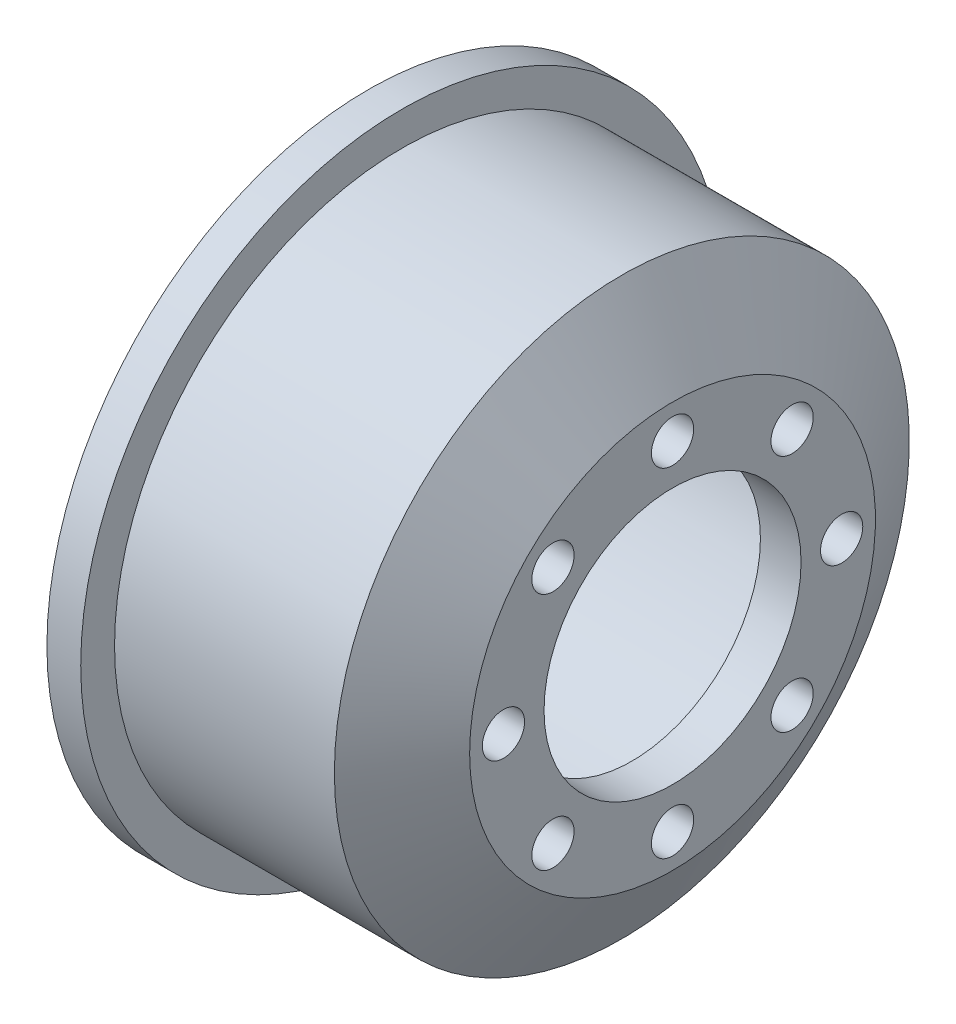
ISO-10303-21;
HEADER;
FILE_DESCRIPTION(('STEP AP214'),'2;1');
FILE_NAME('part.step','',(''),(''),'','','');
FILE_SCHEMA(('AUTOMOTIVE_DESIGN { 1 0 10303 214 1 1 1 1 }'));
ENDSEC;
DATA;
#1=APPLICATION_CONTEXT('core data for automotive mechanical design processes');
#2=APPLICATION_PROTOCOL_DEFINITION('international standard','automotive_design',2000,#1);
#3=PRODUCT_CONTEXT('',#1,'mechanical');
#4=PRODUCT('Part','Part','',(#3));
#5=PRODUCT_RELATED_PRODUCT_CATEGORY('part','',(#4));
#6=PRODUCT_DEFINITION_FORMATION('','',#4);
#7=PRODUCT_DEFINITION_CONTEXT('part definition',#1,'design');
#8=PRODUCT_DEFINITION('design','',#6,#7);
#9=PRODUCT_DEFINITION_SHAPE('','',#8);
#10=(LENGTH_UNIT() NAMED_UNIT(*) SI_UNIT(.MILLI.,.METRE.));
#11=(NAMED_UNIT(*) PLANE_ANGLE_UNIT() SI_UNIT($,.RADIAN.));
#12=(NAMED_UNIT(*) SI_UNIT($,.STERADIAN.) SOLID_ANGLE_UNIT());
#13=UNCERTAINTY_MEASURE_WITH_UNIT(LENGTH_MEASURE(1.E-05),#10,'distance_accuracy_value','');
#14=(GEOMETRIC_REPRESENTATION_CONTEXT(3) GLOBAL_UNCERTAINTY_ASSIGNED_CONTEXT((#13)) GLOBAL_UNIT_ASSIGNED_CONTEXT((#10,
#11,#12)) REPRESENTATION_CONTEXT('',''));
#15=CARTESIAN_POINT('',(0.,0.,0.));
#16=DIRECTION('',(0.,0.,1.));
#17=DIRECTION('',(1.,0.,0.));
#18=AXIS2_PLACEMENT_3D('',#15,#16,#17);
#19=CARTESIAN_POINT('',(-37.2788661687838,0.,0.));
#20=DIRECTION('',(-1.,0.,0.));
#21=DIRECTION('',(0.,0.,1.));
#22=AXIS2_PLACEMENT_3D('',#19,#20,#21);
#23=CYLINDRICAL_SURFACE('',#22,7.6);
#24=CARTESIAN_POINT('',(10.1398131593203,0.,0.));
#25=DIRECTION('',(-1.,0.,0.));
#26=DIRECTION('',(0.,0.,1.));
#27=AXIS2_PLACEMENT_3D('',#24,#25,#26);
#28=CIRCLE('',#27,7.6);
#29=CARTESIAN_POINT('',(10.1398131593203,0.,7.6));
#30=VERTEX_POINT('',#29);
#31=EDGE_CURVE('E10',#30,#30,#28,.T.);
#32=ORIENTED_EDGE('',*,*,#31,.F.);
#33=EDGE_LOOP('',(#32));
#34=FACE_BOUND('',#33,.T.);
#35=CARTESIAN_POINT('',(7.73636722696176,0.,0.));
#36=DIRECTION('',(-1.,0.,0.));
#37=DIRECTION('',(0.,0.,1.));
#38=AXIS2_PLACEMENT_3D('',#35,#36,#37);
#39=CIRCLE('',#38,7.6);
#40=CARTESIAN_POINT('',(7.73636722696176,0.,7.6));
#41=VERTEX_POINT('',#40);
#42=EDGE_CURVE('E71',#41,#41,#39,.T.);
#43=ORIENTED_EDGE('',*,*,#42,.T.);
#44=EDGE_LOOP('',(#43));
#45=FACE_BOUND('',#44,.T.);
#46=ADVANCED_FACE('F32',(#34,#45),#23,.F.);
#47=CARTESIAN_POINT('',(10.1398131593203,0.,-7.6));
#48=DIRECTION('',(-1.,0.,0.));
#49=DIRECTION('',(0.,0.,1.));
#50=AXIS2_PLACEMENT_3D('',#47,#48,#49);
#51=PLANE('',#50);
#52=CARTESIAN_POINT('',(10.1398131593203,10.,0.));
#53=DIRECTION('',(1.,0.,0.));
#54=DIRECTION('',(0.,0.,-1.));
#55=AXIS2_PLACEMENT_3D('',#52,#53,#54);
#56=CIRCLE('',#55,1.25);
#57=CARTESIAN_POINT('',(10.1398131593203,10.,-1.25));
#58=VERTEX_POINT('',#57);
#59=EDGE_CURVE('E52',#58,#58,#56,.T.);
#60=ORIENTED_EDGE('',*,*,#59,.F.);
#61=EDGE_LOOP('',(#60));
#62=FACE_BOUND('',#61,.T.);
#63=CARTESIAN_POINT('',(10.1398131593203,7.07106781186578,-7.0710678118656));
#64=DIRECTION('',(1.,0.,0.));
#65=DIRECTION('',(0.,0.,-1.));
#66=AXIS2_PLACEMENT_3D('',#63,#64,#65);
#67=CIRCLE('',#66,1.25000000000005);
#68=CARTESIAN_POINT('',(10.1398131593203,7.07106781186578,-8.32106781186565));
#69=VERTEX_POINT('',#68);
#70=EDGE_CURVE('E195',#69,#69,#67,.T.);
#71=ORIENTED_EDGE('',*,*,#70,.F.);
#72=EDGE_LOOP('',(#71));
#73=FACE_BOUND('',#72,.T.);
#74=CARTESIAN_POINT('',(10.1398131593203,4.24488671257339E-13,-10.0000000000004));
#75=DIRECTION('',(1.,0.,0.));
#76=DIRECTION('',(0.,0.,-1.));
#77=AXIS2_PLACEMENT_3D('',#74,#75,#76);
#78=CIRCLE('',#77,1.25000000000032);
#79=CARTESIAN_POINT('',(10.1398131593203,4.24488671257339E-13,-11.2500000000007));
#80=VERTEX_POINT('',#79);
#81=EDGE_CURVE('E198',#80,#80,#78,.T.);
#82=ORIENTED_EDGE('',*,*,#81,.F.);
#83=EDGE_LOOP('',(#82));
#84=FACE_BOUND('',#83,.T.);
#85=CARTESIAN_POINT('',(10.1398131593203,-7.07106781186517,-7.0710678118662));
#86=DIRECTION('',(1.,0.,0.));
#87=DIRECTION('',(0.,0.,-1.));
#88=AXIS2_PLACEMENT_3D('',#85,#86,#87);
#89=CIRCLE('',#88,1.25000000000066);
#90=CARTESIAN_POINT('',(10.1398131593203,-7.07106781186517,-8.32106781186686));
#91=VERTEX_POINT('',#90);
#92=EDGE_CURVE('E203',#91,#91,#89,.T.);
#93=ORIENTED_EDGE('',*,*,#92,.F.);
#94=EDGE_LOOP('',(#93));
#95=FACE_BOUND('',#94,.T.);
#96=CARTESIAN_POINT('',(10.1398131593203,-10.,-8.48977342514678E-13));
#97=DIRECTION('',(1.,0.,0.));
#98=DIRECTION('',(0.,0.,-1.));
#99=AXIS2_PLACEMENT_3D('',#96,#97,#98);
#100=CIRCLE('',#99,1.25000000000088);
#101=CARTESIAN_POINT('',(10.1398131593203,-10.,-1.25000000000173));
#102=VERTEX_POINT('',#101);
#103=EDGE_CURVE('E206',#102,#102,#100,.T.);
#104=ORIENTED_EDGE('',*,*,#103,.F.);
#105=EDGE_LOOP('',(#104));
#106=FACE_BOUND('',#105,.T.);
#107=CARTESIAN_POINT('',(10.1398131593203,-7.07106781186578,7.07106781186475));
#108=DIRECTION('',(1.,0.,0.));
#109=DIRECTION('',(0.,0.,-1.));
#110=AXIS2_PLACEMENT_3D('',#107,#108,#109);
#111=CIRCLE('',#110,1.25000000000086);
#112=CARTESIAN_POINT('',(10.1398131593203,-7.07106781186578,5.82106781186389));
#113=VERTEX_POINT('',#112);
#114=EDGE_CURVE('E209',#113,#113,#111,.T.);
#115=ORIENTED_EDGE('',*,*,#114,.F.);
#116=EDGE_LOOP('',(#115));
#117=FACE_BOUND('',#116,.T.);
#118=CARTESIAN_POINT('',(10.1398131593203,-4.25713318056486E-13,9.99999999999958));
#119=DIRECTION('',(1.,0.,0.));
#120=DIRECTION('',(0.,0.,-1.));
#121=AXIS2_PLACEMENT_3D('',#118,#119,#120);
#122=CIRCLE('',#121,1.25000000000063);
#123=CARTESIAN_POINT('',(10.1398131593203,-4.25713318056486E-13,8.74999999999895));
#124=VERTEX_POINT('',#123);
#125=EDGE_CURVE('E211',#124,#124,#122,.T.);
#126=ORIENTED_EDGE('',*,*,#125,.F.);
#127=EDGE_LOOP('',(#126));
#128=FACE_BOUND('',#127,.T.);
#129=CARTESIAN_POINT('',(10.1398131593203,7.07106781186517,7.07106781186535));
#130=DIRECTION('',(1.,0.,0.));
#131=DIRECTION('',(0.,0.,-1.));
#132=AXIS2_PLACEMENT_3D('',#129,#130,#131);
#133=CIRCLE('',#132,1.25000000000032);
#134=CARTESIAN_POINT('',(10.1398131593203,7.07106781186517,5.82106781186503));
#135=VERTEX_POINT('',#134);
#136=EDGE_CURVE('E83',#135,#135,#133,.T.);
#137=ORIENTED_EDGE('',*,*,#136,.F.);
#138=EDGE_LOOP('',(#137));
#139=FACE_BOUND('',#138,.T.);
#140=CARTESIAN_POINT('',(10.1398131593203,0.,0.));
#141=DIRECTION('',(-1.,0.,0.));
#142=DIRECTION('',(0.,0.,1.));
#143=AXIS2_PLACEMENT_3D('',#140,#141,#142);
#144=CIRCLE('',#143,12.);
#145=CARTESIAN_POINT('',(10.1398131593203,0.,12.));
#146=VERTEX_POINT('',#145);
#147=EDGE_CURVE('E39',#146,#146,#144,.T.);
#148=ORIENTED_EDGE('',*,*,#147,.F.);
#149=EDGE_LOOP('',(#148));
#150=FACE_BOUND('',#149,.T.);
#151=ORIENTED_EDGE('',*,*,#31,.T.);
#152=EDGE_LOOP('',(#151));
#153=FACE_BOUND('',#152,.T.);
#154=ADVANCED_FACE('F113',(#62,#73,#84,#95,#106,#117,#128,#139,#150,#153),#51,.F.);
#155=CARTESIAN_POINT('',(10.1398131593203,0.,0.));
#156=DIRECTION('',(-1.,0.,0.));
#157=DIRECTION('',(0.,0.,1.));
#158=AXIS2_PLACEMENT_3D('',#155,#156,#157);
#159=CONICAL_SURFACE('',#158,12.,1.03037682652431);
#160=CARTESIAN_POINT('',(7.13981315932029,0.,0.));
#161=DIRECTION('',(-1.,0.,0.));
#162=DIRECTION('',(0.,0.,1.));
#163=AXIS2_PLACEMENT_3D('',#160,#161,#162);
#164=CIRCLE('',#163,17.);
#165=CARTESIAN_POINT('',(7.13981315932029,0.,17.));
#166=VERTEX_POINT('',#165);
#167=EDGE_CURVE('E44',#166,#166,#164,.T.);
#168=ORIENTED_EDGE('',*,*,#167,.F.);
#169=EDGE_LOOP('',(#168));
#170=FACE_BOUND('',#169,.T.);
#171=ORIENTED_EDGE('',*,*,#147,.T.);
#172=EDGE_LOOP('',(#171));
#173=FACE_BOUND('',#172,.T.);
#174=ADVANCED_FACE('F110',(#170,#173),#159,.T.);
#175=CARTESIAN_POINT('',(-37.2788661687838,0.,0.));
#176=DIRECTION('',(-1.,0.,0.));
#177=DIRECTION('',(0.,0.,1.));
#178=AXIS2_PLACEMENT_3D('',#175,#176,#177);
#179=CYLINDRICAL_SURFACE('',#178,17.);
#180=CARTESIAN_POINT('',(-5.86018684067971,0.,0.));
#181=DIRECTION('',(-1.,0.,0.));
#182=DIRECTION('',(0.,0.,1.));
#183=AXIS2_PLACEMENT_3D('',#180,#181,#182);
#184=CIRCLE('',#183,17.);
#185=CARTESIAN_POINT('',(-5.86018684067971,0.,17.));
#186=VERTEX_POINT('',#185);
#187=EDGE_CURVE('E103',#186,#186,#184,.T.);
#188=ORIENTED_EDGE('',*,*,#187,.F.);
#189=EDGE_LOOP('',(#188));
#190=FACE_BOUND('',#189,.T.);
#191=ORIENTED_EDGE('',*,*,#167,.T.);
#192=EDGE_LOOP('',(#191));
#193=FACE_BOUND('',#192,.T.);
#194=ADVANCED_FACE('F108',(#190,#193),#179,.T.);
#195=CARTESIAN_POINT('',(-5.86018684067971,0.,-19.));
#196=DIRECTION('',(-1.,0.,0.));
#197=DIRECTION('',(0.,0.,1.));
#198=AXIS2_PLACEMENT_3D('',#195,#196,#197);
#199=PLANE('',#198);
#200=CARTESIAN_POINT('',(-5.86018684067971,0.,0.));
#201=DIRECTION('',(-1.,0.,0.));
#202=DIRECTION('',(0.,0.,1.));
#203=AXIS2_PLACEMENT_3D('',#200,#201,#202);
#204=CIRCLE('',#203,19.);
#205=CARTESIAN_POINT('',(-5.86018684067971,0.,19.));
#206=VERTEX_POINT('',#205);
#207=EDGE_CURVE('E100',#206,#206,#204,.T.);
#208=ORIENTED_EDGE('',*,*,#207,.F.);
#209=EDGE_LOOP('',(#208));
#210=FACE_BOUND('',#209,.T.);
#211=ORIENTED_EDGE('',*,*,#187,.T.);
#212=EDGE_LOOP('',(#211));
#213=FACE_BOUND('',#212,.T.);
#214=ADVANCED_FACE('F128',(#210,#213),#199,.F.);
#215=CARTESIAN_POINT('',(-37.2788661687838,0.,0.));
#216=DIRECTION('',(-1.,0.,0.));
#217=DIRECTION('',(0.,0.,1.));
#218=AXIS2_PLACEMENT_3D('',#215,#216,#217);
#219=CYLINDRICAL_SURFACE('',#218,19.);
#220=CARTESIAN_POINT('',(-7.86018684067971,0.,0.));
#221=DIRECTION('',(-1.,0.,0.));
#222=DIRECTION('',(0.,0.,1.));
#223=AXIS2_PLACEMENT_3D('',#220,#221,#222);
#224=CIRCLE('',#223,19.);
#225=CARTESIAN_POINT('',(-7.86018684067971,0.,19.));
#226=VERTEX_POINT('',#225);
#227=EDGE_CURVE('E97',#226,#226,#224,.T.);
#228=ORIENTED_EDGE('',*,*,#227,.F.);
#229=EDGE_LOOP('',(#228));
#230=FACE_BOUND('',#229,.T.);
#231=ORIENTED_EDGE('',*,*,#207,.T.);
#232=EDGE_LOOP('',(#231));
#233=FACE_BOUND('',#232,.T.);
#234=ADVANCED_FACE('F132',(#230,#233),#219,.T.);
#235=CARTESIAN_POINT('',(-7.86018684067971,0.,-19.));
#236=DIRECTION('',(1.,0.,0.));
#237=DIRECTION('',(0.,0.,-1.));
#238=AXIS2_PLACEMENT_3D('',#235,#236,#237);
#239=PLANE('',#238);
#240=CARTESIAN_POINT('',(-7.8601868406797,0.,0.));
#241=DIRECTION('',(-1.,0.,0.));
#242=DIRECTION('',(0.,0.,1.));
#243=AXIS2_PLACEMENT_3D('',#240,#241,#242);
#244=CIRCLE('',#243,18.);
#245=CARTESIAN_POINT('',(-7.8601868406797,0.,18.));
#246=VERTEX_POINT('',#245);
#247=EDGE_CURVE('E94',#246,#246,#244,.T.);
#248=ORIENTED_EDGE('',*,*,#247,.F.);
#249=EDGE_LOOP('',(#248));
#250=FACE_BOUND('',#249,.T.);
#251=ORIENTED_EDGE('',*,*,#227,.T.);
#252=EDGE_LOOP('',(#251));
#253=FACE_BOUND('',#252,.T.);
#254=ADVANCED_FACE('F136',(#250,#253),#239,.F.);
#255=CARTESIAN_POINT('',(-37.2788661687838,0.,0.));
#256=DIRECTION('',(-1.,0.,0.));
#257=DIRECTION('',(0.,0.,1.));
#258=AXIS2_PLACEMENT_3D('',#255,#256,#257);
#259=CYLINDRICAL_SURFACE('',#258,18.);
#260=CARTESIAN_POINT('',(-7.36018684067971,0.,0.));
#261=DIRECTION('',(-1.,0.,0.));
#262=DIRECTION('',(0.,0.,1.));
#263=AXIS2_PLACEMENT_3D('',#260,#261,#262);
#264=CIRCLE('',#263,18.);
#265=CARTESIAN_POINT('',(-7.36018684067971,0.,18.));
#266=VERTEX_POINT('',#265);
#267=EDGE_CURVE('E91',#266,#266,#264,.T.);
#268=ORIENTED_EDGE('',*,*,#267,.F.);
#269=EDGE_LOOP('',(#268));
#270=FACE_BOUND('',#269,.T.);
#271=ORIENTED_EDGE('',*,*,#247,.T.);
#272=EDGE_LOOP('',(#271));
#273=FACE_BOUND('',#272,.T.);
#274=ADVANCED_FACE('F140',(#270,#273),#259,.F.);
#275=CARTESIAN_POINT('',(-7.36018684067971,0.,-14.55));
#276=DIRECTION('',(1.,0.,0.));
#277=DIRECTION('',(0.,0.,-1.));
#278=AXIS2_PLACEMENT_3D('',#275,#276,#277);
#279=PLANE('',#278);
#280=CARTESIAN_POINT('',(-7.36018684067971,0.,0.));
#281=DIRECTION('',(-1.,0.,0.));
#282=DIRECTION('',(0.,0.,1.));
#283=AXIS2_PLACEMENT_3D('',#280,#281,#282);
#284=CIRCLE('',#283,14.55);
#285=CARTESIAN_POINT('',(-7.36018684067971,0.,14.55));
#286=VERTEX_POINT('',#285);
#287=EDGE_CURVE('E88',#286,#286,#284,.T.);
#288=ORIENTED_EDGE('',*,*,#287,.F.);
#289=EDGE_LOOP('',(#288));
#290=FACE_BOUND('',#289,.T.);
#291=ORIENTED_EDGE('',*,*,#267,.T.);
#292=EDGE_LOOP('',(#291));
#293=FACE_BOUND('',#292,.T.);
#294=ADVANCED_FACE('F144',(#290,#293),#279,.F.);
#295=CARTESIAN_POINT('',(-37.2788661687838,0.,0.));
#296=DIRECTION('',(-1.,0.,0.));
#297=DIRECTION('',(0.,0.,1.));
#298=AXIS2_PLACEMENT_3D('',#295,#296,#297);
#299=CYLINDRICAL_SURFACE('',#298,14.55);
#300=CARTESIAN_POINT('',(6.08993501534973,0.,0.));
#301=DIRECTION('',(-1.,0.,0.));
#302=DIRECTION('',(0.,0.,1.));
#303=AXIS2_PLACEMENT_3D('',#300,#301,#302);
#304=CIRCLE('',#303,14.55);
#305=CARTESIAN_POINT('',(6.08993501534973,0.,14.55));
#306=VERTEX_POINT('',#305);
#307=EDGE_CURVE('E80',#306,#306,#304,.T.);
#308=ORIENTED_EDGE('',*,*,#307,.F.);
#309=EDGE_LOOP('',(#308));
#310=FACE_BOUND('',#309,.T.);
#311=ORIENTED_EDGE('',*,*,#287,.T.);
#312=EDGE_LOOP('',(#311));
#313=FACE_BOUND('',#312,.T.);
#314=ADVANCED_FACE('F148',(#310,#313),#299,.F.);
#315=CARTESIAN_POINT('',(6.08993501534973,0.,0.));
#316=DIRECTION('',(-1.,0.,0.));
#317=DIRECTION('',(0.,0.,1.));
#318=AXIS2_PLACEMENT_3D('',#315,#316,#317);
#319=CONICAL_SURFACE('',#318,14.55,1.03037682652431);
#320=CARTESIAN_POINT('',(7.73636722696176,0.,0.));
#321=DIRECTION('',(-1.,0.,0.));
#322=DIRECTION('',(0.,0.,1.));
#323=AXIS2_PLACEMENT_3D('',#320,#321,#322);
#324=CIRCLE('',#323,11.80594631398);
#325=CARTESIAN_POINT('',(7.73636722696176,0.,11.80594631398));
#326=VERTEX_POINT('',#325);
#327=EDGE_CURVE('E75',#326,#326,#324,.T.);
#328=ORIENTED_EDGE('',*,*,#327,.F.);
#329=EDGE_LOOP('',(#328));
#330=FACE_BOUND('',#329,.T.);
#331=ORIENTED_EDGE('',*,*,#307,.T.);
#332=EDGE_LOOP('',(#331));
#333=FACE_BOUND('',#332,.T.);
#334=ADVANCED_FACE('F152',(#330,#333),#319,.F.);
#335=CARTESIAN_POINT('',(7.73636722696176,0.,-11.80594631398));
#336=DIRECTION('',(1.,0.,0.));
#337=DIRECTION('',(0.,0.,-1.));
#338=AXIS2_PLACEMENT_3D('',#335,#336,#337);
#339=PLANE('',#338);
#340=CARTESIAN_POINT('',(7.73636722696176,10.,0.));
#341=DIRECTION('',(1.,0.,0.));
#342=DIRECTION('',(0.,0.,-1.));
#343=AXIS2_PLACEMENT_3D('',#340,#341,#342);
#344=CIRCLE('',#343,1.25);
#345=CARTESIAN_POINT('',(7.73636722696176,10.,-1.25));
#346=VERTEX_POINT('',#345);
#347=EDGE_CURVE('E35',#346,#346,#344,.T.);
#348=ORIENTED_EDGE('',*,*,#347,.T.);
#349=EDGE_LOOP('',(#348));
#350=FACE_BOUND('',#349,.T.);
#351=CARTESIAN_POINT('',(7.73636722696176,7.07106781186578,-7.0710678118656));
#352=DIRECTION('',(1.,0.,0.));
#353=DIRECTION('',(0.,0.,-1.));
#354=AXIS2_PLACEMENT_3D('',#351,#352,#353);
#355=CIRCLE('',#354,1.25000000000005);
#356=CARTESIAN_POINT('',(7.73636722696176,7.07106781186578,-8.32106781186565));
#357=VERTEX_POINT('',#356);
#358=EDGE_CURVE('E66',#357,#357,#355,.T.);
#359=ORIENTED_EDGE('',*,*,#358,.T.);
#360=EDGE_LOOP('',(#359));
#361=FACE_BOUND('',#360,.T.);
#362=CARTESIAN_POINT('',(7.73636722696176,4.24488671257339E-13,-10.0000000000004));
#363=DIRECTION('',(1.,0.,0.));
#364=DIRECTION('',(0.,0.,-1.));
#365=AXIS2_PLACEMENT_3D('',#362,#363,#364);
#366=CIRCLE('',#365,1.25000000000032);
#367=CARTESIAN_POINT('',(7.73636722696176,4.24488671257339E-13,-11.2500000000007));
#368=VERTEX_POINT('',#367);
#369=EDGE_CURVE('E64',#368,#368,#366,.T.);
#370=ORIENTED_EDGE('',*,*,#369,.T.);
#371=EDGE_LOOP('',(#370));
#372=FACE_BOUND('',#371,.T.);
#373=CARTESIAN_POINT('',(7.73636722696176,-7.07106781186517,-7.0710678118662));
#374=DIRECTION('',(1.,0.,0.));
#375=DIRECTION('',(0.,0.,-1.));
#376=AXIS2_PLACEMENT_3D('',#373,#374,#375);
#377=CIRCLE('',#376,1.25000000000066);
#378=CARTESIAN_POINT('',(7.73636722696176,-7.07106781186517,-8.32106781186686));
#379=VERTEX_POINT('',#378);
#380=EDGE_CURVE('E61',#379,#379,#377,.T.);
#381=ORIENTED_EDGE('',*,*,#380,.T.);
#382=EDGE_LOOP('',(#381));
#383=FACE_BOUND('',#382,.T.);
#384=CARTESIAN_POINT('',(7.73636722696176,-10.,-8.48977342514678E-13));
#385=DIRECTION('',(1.,0.,0.));
#386=DIRECTION('',(0.,0.,-1.));
#387=AXIS2_PLACEMENT_3D('',#384,#385,#386);
#388=CIRCLE('',#387,1.25000000000088);
#389=CARTESIAN_POINT('',(7.73636722696176,-10.,-1.25000000000173));
#390=VERTEX_POINT('',#389);
#391=EDGE_CURVE('E58',#390,#390,#388,.T.);
#392=ORIENTED_EDGE('',*,*,#391,.T.);
#393=EDGE_LOOP('',(#392));
#394=FACE_BOUND('',#393,.T.);
#395=CARTESIAN_POINT('',(7.73636722696176,-7.07106781186578,7.07106781186475));
#396=DIRECTION('',(1.,0.,0.));
#397=DIRECTION('',(0.,0.,-1.));
#398=AXIS2_PLACEMENT_3D('',#395,#396,#397);
#399=CIRCLE('',#398,1.25000000000086);
#400=CARTESIAN_POINT('',(7.73636722696176,-7.07106781186578,5.82106781186389));
#401=VERTEX_POINT('',#400);
#402=EDGE_CURVE('E55',#401,#401,#399,.T.);
#403=ORIENTED_EDGE('',*,*,#402,.T.);
#404=EDGE_LOOP('',(#403));
#405=FACE_BOUND('',#404,.T.);
#406=CARTESIAN_POINT('',(7.73636722696176,-4.25713318056486E-13,9.99999999999958));
#407=DIRECTION('',(1.,0.,0.));
#408=DIRECTION('',(0.,0.,-1.));
#409=AXIS2_PLACEMENT_3D('',#406,#407,#408);
#410=CIRCLE('',#409,1.25000000000063);
#411=CARTESIAN_POINT('',(7.73636722696176,-4.25713318056486E-13,8.74999999999895));
#412=VERTEX_POINT('',#411);
#413=EDGE_CURVE('E51',#412,#412,#410,.T.);
#414=ORIENTED_EDGE('',*,*,#413,.T.);
#415=EDGE_LOOP('',(#414));
#416=FACE_BOUND('',#415,.T.);
#417=CARTESIAN_POINT('',(7.73636722696176,7.07106781186517,7.07106781186535));
#418=DIRECTION('',(1.,0.,0.));
#419=DIRECTION('',(0.,0.,-1.));
#420=AXIS2_PLACEMENT_3D('',#417,#418,#419);
#421=CIRCLE('',#420,1.25000000000032);
#422=CARTESIAN_POINT('',(7.73636722696176,7.07106781186517,5.82106781186503));
#423=VERTEX_POINT('',#422);
#424=EDGE_CURVE('E48',#423,#423,#421,.T.);
#425=ORIENTED_EDGE('',*,*,#424,.T.);
#426=EDGE_LOOP('',(#425));
#427=FACE_BOUND('',#426,.T.);
#428=ORIENTED_EDGE('',*,*,#42,.F.);
#429=EDGE_LOOP('',(#428));
#430=FACE_BOUND('',#429,.T.);
#431=ORIENTED_EDGE('',*,*,#327,.T.);
#432=EDGE_LOOP('',(#431));
#433=FACE_BOUND('',#432,.T.);
#434=ADVANCED_FACE('F156',(#350,#361,#372,#383,#394,#405,#416,#427,#430,#433),#339,.F.);
#435=CARTESIAN_POINT('',(-7.86018684067971,7.07106781186517,7.07106781186535));
#436=DIRECTION('',(1.,0.,0.));
#437=DIRECTION('',(0.,0.,-1.));
#438=AXIS2_PLACEMENT_3D('',#435,#436,#437);
#439=CYLINDRICAL_SURFACE('',#438,1.25000000000032);
#440=ORIENTED_EDGE('',*,*,#136,.T.);
#441=EDGE_LOOP('',(#440));
#442=FACE_BOUND('',#441,.T.);
#443=ORIENTED_EDGE('',*,*,#424,.F.);
#444=EDGE_LOOP('',(#443));
#445=FACE_BOUND('',#444,.T.);
#446=ADVANCED_FACE('F160',(#442,#445),#439,.F.);
#447=CARTESIAN_POINT('',(-7.86018684067971,-4.25713318056486E-13,9.99999999999958));
#448=DIRECTION('',(1.,0.,0.));
#449=DIRECTION('',(0.,0.,-1.));
#450=AXIS2_PLACEMENT_3D('',#447,#448,#449);
#451=CYLINDRICAL_SURFACE('',#450,1.25000000000063);
#452=ORIENTED_EDGE('',*,*,#125,.T.);
#453=EDGE_LOOP('',(#452));
#454=FACE_BOUND('',#453,.T.);
#455=ORIENTED_EDGE('',*,*,#413,.F.);
#456=EDGE_LOOP('',(#455));
#457=FACE_BOUND('',#456,.T.);
#458=ADVANCED_FACE('F163',(#454,#457),#451,.F.);
#459=CARTESIAN_POINT('',(-7.86018684067971,-7.07106781186578,7.07106781186475));
#460=DIRECTION('',(1.,0.,0.));
#461=DIRECTION('',(0.,0.,-1.));
#462=AXIS2_PLACEMENT_3D('',#459,#460,#461);
#463=CYLINDRICAL_SURFACE('',#462,1.25000000000086);
#464=ORIENTED_EDGE('',*,*,#114,.T.);
#465=EDGE_LOOP('',(#464));
#466=FACE_BOUND('',#465,.T.);
#467=ORIENTED_EDGE('',*,*,#402,.F.);
#468=EDGE_LOOP('',(#467));
#469=FACE_BOUND('',#468,.T.);
#470=ADVANCED_FACE('F167',(#466,#469),#463,.F.);
#471=CARTESIAN_POINT('',(-7.86018684067971,-10.,-8.48977342514678E-13));
#472=DIRECTION('',(1.,0.,0.));
#473=DIRECTION('',(0.,0.,-1.));
#474=AXIS2_PLACEMENT_3D('',#471,#472,#473);
#475=CYLINDRICAL_SURFACE('',#474,1.25000000000088);
#476=ORIENTED_EDGE('',*,*,#103,.T.);
#477=EDGE_LOOP('',(#476));
#478=FACE_BOUND('',#477,.T.);
#479=ORIENTED_EDGE('',*,*,#391,.F.);
#480=EDGE_LOOP('',(#479));
#481=FACE_BOUND('',#480,.T.);
#482=ADVANCED_FACE('F171',(#478,#481),#475,.F.);
#483=CARTESIAN_POINT('',(-7.86018684067971,-7.07106781186517,-7.0710678118662));
#484=DIRECTION('',(1.,0.,0.));
#485=DIRECTION('',(0.,0.,-1.));
#486=AXIS2_PLACEMENT_3D('',#483,#484,#485);
#487=CYLINDRICAL_SURFACE('',#486,1.25000000000066);
#488=ORIENTED_EDGE('',*,*,#92,.T.);
#489=EDGE_LOOP('',(#488));
#490=FACE_BOUND('',#489,.T.);
#491=ORIENTED_EDGE('',*,*,#380,.F.);
#492=EDGE_LOOP('',(#491));
#493=FACE_BOUND('',#492,.T.);
#494=ADVANCED_FACE('F175',(#490,#493),#487,.F.);
#495=CARTESIAN_POINT('',(-7.86018684067971,4.24488671257339E-13,-10.0000000000004));
#496=DIRECTION('',(1.,0.,0.));
#497=DIRECTION('',(0.,0.,-1.));
#498=AXIS2_PLACEMENT_3D('',#495,#496,#497);
#499=CYLINDRICAL_SURFACE('',#498,1.25000000000032);
#500=ORIENTED_EDGE('',*,*,#81,.T.);
#501=EDGE_LOOP('',(#500));
#502=FACE_BOUND('',#501,.T.);
#503=ORIENTED_EDGE('',*,*,#369,.F.);
#504=EDGE_LOOP('',(#503));
#505=FACE_BOUND('',#504,.T.);
#506=ADVANCED_FACE('F179',(#502,#505),#499,.F.);
#507=CARTESIAN_POINT('',(-7.86018684067971,7.07106781186578,-7.0710678118656));
#508=DIRECTION('',(1.,0.,0.));
#509=DIRECTION('',(0.,0.,-1.));
#510=AXIS2_PLACEMENT_3D('',#507,#508,#509);
#511=CYLINDRICAL_SURFACE('',#510,1.25000000000005);
#512=ORIENTED_EDGE('',*,*,#70,.T.);
#513=EDGE_LOOP('',(#512));
#514=FACE_BOUND('',#513,.T.);
#515=ORIENTED_EDGE('',*,*,#358,.F.);
#516=EDGE_LOOP('',(#515));
#517=FACE_BOUND('',#516,.T.);
#518=ADVANCED_FACE('F183',(#514,#517),#511,.F.);
#519=CARTESIAN_POINT('',(-7.86018684067971,10.,0.));
#520=DIRECTION('',(1.,0.,0.));
#521=DIRECTION('',(0.,0.,-1.));
#522=AXIS2_PLACEMENT_3D('',#519,#520,#521);
#523=CYLINDRICAL_SURFACE('',#522,1.25);
#524=ORIENTED_EDGE('',*,*,#59,.T.);
#525=EDGE_LOOP('',(#524));
#526=FACE_BOUND('',#525,.T.);
#527=ORIENTED_EDGE('',*,*,#347,.F.);
#528=EDGE_LOOP('',(#527));
#529=FACE_BOUND('',#528,.T.);
#530=ADVANCED_FACE('F187',(#526,#529),#523,.F.);
#531=CLOSED_SHELL('',(#46,#154,#174,#194,#214,#234,#254,#274,#294,#314,#334,#434,#446,#458,#470,
#482,#494,#506,#518,#530));
#532=MANIFOLD_SOLID_BREP('B2',#531);
#533=ADVANCED_BREP_SHAPE_REPRESENTATION('',(#18,#532),#14);
#534=SHAPE_DEFINITION_REPRESENTATION(#9,#533);
ENDSEC;
END-ISO-10303-21;
